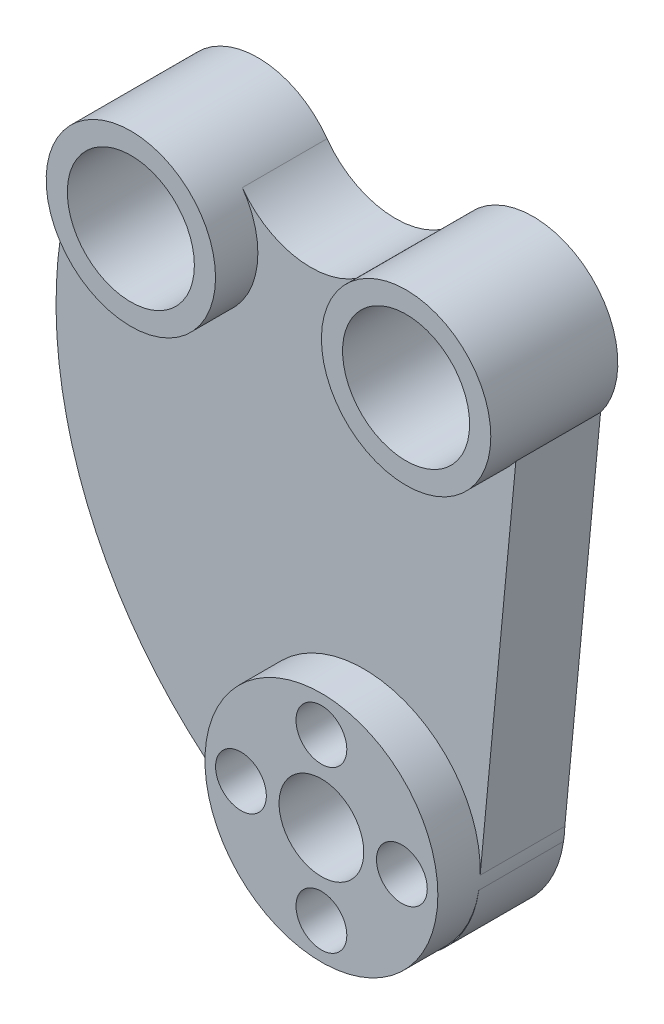
ISO-10303-21;
HEADER;
FILE_DESCRIPTION(('STEP AP214'),'2;1');
FILE_NAME('part.step','',(''),(''),'','','');
FILE_SCHEMA(('AUTOMOTIVE_DESIGN { 1 0 10303 214 1 1 1 1 }'));
ENDSEC;
DATA;
#1=APPLICATION_CONTEXT('core data for automotive mechanical design processes');
#2=APPLICATION_PROTOCOL_DEFINITION('international standard','automotive_design',2000,#1);
#3=PRODUCT_CONTEXT('',#1,'mechanical');
#4=PRODUCT('Part','Part','',(#3));
#5=PRODUCT_RELATED_PRODUCT_CATEGORY('part','',(#4));
#6=PRODUCT_DEFINITION_FORMATION('','',#4);
#7=PRODUCT_DEFINITION_CONTEXT('part definition',#1,'design');
#8=PRODUCT_DEFINITION('design','',#6,#7);
#9=PRODUCT_DEFINITION_SHAPE('','',#8);
#10=(LENGTH_UNIT() NAMED_UNIT(*) SI_UNIT(.MILLI.,.METRE.));
#11=(NAMED_UNIT(*) PLANE_ANGLE_UNIT() SI_UNIT($,.RADIAN.));
#12=(NAMED_UNIT(*) SI_UNIT($,.STERADIAN.) SOLID_ANGLE_UNIT());
#13=UNCERTAINTY_MEASURE_WITH_UNIT(LENGTH_MEASURE(1.E-05),#10,'distance_accuracy_value','');
#14=(GEOMETRIC_REPRESENTATION_CONTEXT(3) GLOBAL_UNCERTAINTY_ASSIGNED_CONTEXT((#13)) GLOBAL_UNIT_ASSIGNED_CONTEXT((#10,
#11,#12)) REPRESENTATION_CONTEXT('',''));
#15=CARTESIAN_POINT('',(0.,0.,0.));
#16=DIRECTION('',(0.,0.,1.));
#17=DIRECTION('',(1.,0.,0.));
#18=AXIS2_PLACEMENT_3D('',#15,#16,#17);
#19=CARTESIAN_POINT('',(25.3358041187193,65.7939812133354,20.));
#20=DIRECTION('',(0.,0.,-1.));
#21=DIRECTION('',(-1.,0.,0.));
#22=AXIS2_PLACEMENT_3D('',#19,#20,#21);
#23=CYLINDRICAL_SURFACE('',#22,98.);
#24=DIRECTION('',(0.,0.,-1.));
#25=VECTOR('',#24,1.);
#26=CARTESIAN_POINT('',(-10.3668097873622,-25.471145534362,15.));
#27=LINE('',#26,#25);
#28=CARTESIAN_POINT('',(-10.3668097873622,-25.471145534362,20.));
#29=VERTEX_POINT('',#28);
#30=CARTESIAN_POINT('',(-10.3668097873635,-25.4711455343615,0.));
#31=VERTEX_POINT('',#30);
#32=EDGE_CURVE('E126',#29,#31,#27,.T.);
#33=ORIENTED_EDGE('',*,*,#32,.F.);
#34=CARTESIAN_POINT('',(25.3358041187193,65.7939812133354,20.));
#35=DIRECTION('',(0.,0.,1.));
#36=DIRECTION('',(-1.,0.,0.));
#37=AXIS2_PLACEMENT_3D('',#34,#35,#36);
#38=CIRCLE('',#37,98.);
#39=CARTESIAN_POINT('',(-64.1691823820229,105.704598741782,20.));
#40=VERTEX_POINT('',#39);
#41=EDGE_CURVE('E113',#40,#29,#38,.T.);
#42=ORIENTED_EDGE('',*,*,#41,.F.);
#43=DIRECTION('',(0.,0.,-1.));
#44=VECTOR('',#43,1.);
#45=CARTESIAN_POINT('',(-64.169182382023,105.704598741782,10.));
#46=LINE('',#45,#44);
#47=CARTESIAN_POINT('',(-64.1691823820229,105.704598741782,0.));
#48=VERTEX_POINT('',#47);
#49=EDGE_CURVE('E137',#40,#48,#46,.T.);
#50=ORIENTED_EDGE('',*,*,#49,.T.);
#51=CARTESIAN_POINT('',(25.3358041187193,65.7939812133354,0.));
#52=DIRECTION('',(0.,0.,1.));
#53=DIRECTION('',(-1.,0.,0.));
#54=AXIS2_PLACEMENT_3D('',#51,#52,#53);
#55=CIRCLE('',#54,98.);
#56=EDGE_CURVE('E127',#48,#31,#55,.T.);
#57=ORIENTED_EDGE('',*,*,#56,.T.);
#58=EDGE_LOOP('',(#33,#42,#50,#57));
#59=FACE_BOUND('',#58,.T.);
#60=ADVANCED_FACE('F41',(#59),#23,.T.);
#61=CARTESIAN_POINT('',(35.9145681731066,87.8869277281302,20.));
#62=DIRECTION('',(-0.995528702857824,0.0944595245923769,0.));
#63=DIRECTION('',(-0.0944595245923769,-0.995528702857824,0.));
#64=AXIS2_PLACEMENT_3D('',#61,#62,#63);
#65=PLANE('',#64);
#66=DIRECTION('',(0.,0.,-1.));
#67=VECTOR('',#66,1.);
#68=CARTESIAN_POINT('',(27.4825292126796,-0.980095951533919,30.));
#69=LINE('',#68,#67);
#70=CARTESIAN_POINT('',(27.4825292126796,-0.980095951533894,0.));
#71=VERTEX_POINT('',#70);
#72=CARTESIAN_POINT('',(27.4825292126796,-0.980095951533919,20.));
#73=VERTEX_POINT('',#72);
#74=EDGE_CURVE('E68',#71,#73,#69,.F.);
#75=ORIENTED_EDGE('',*,*,#74,.F.);
#76=DIRECTION('',(0.0944595245923769,0.995528702857824,0.));
#77=VECTOR('',#76,1.);
#78=CARTESIAN_POINT('',(35.9145681731066,87.8869277281302,0.));
#79=LINE('',#78,#77);
#80=CARTESIAN_POINT('',(35.9145681731068,87.8869277281301,0.));
#81=VERTEX_POINT('',#80);
#82=EDGE_CURVE('E225',#71,#81,#79,.T.);
#83=ORIENTED_EDGE('',*,*,#82,.T.);
#84=DIRECTION('',(0.,0.,-1.));
#85=VECTOR('',#84,1.);
#86=CARTESIAN_POINT('',(35.9145681731068,87.8869277281301,20.));
#87=LINE('',#86,#85);
#88=CARTESIAN_POINT('',(35.9145681731066,87.8869277281302,20.));
#89=VERTEX_POINT('',#88);
#90=EDGE_CURVE('E255',#89,#81,#87,.T.);
#91=ORIENTED_EDGE('',*,*,#90,.F.);
#92=DIRECTION('',(0.0944595245923769,0.995528702857824,0.));
#93=VECTOR('',#92,1.);
#94=CARTESIAN_POINT('',(35.9145681731066,87.8869277281302,20.));
#95=LINE('',#94,#93);
#96=EDGE_CURVE('E241',#73,#89,#95,.T.);
#97=ORIENTED_EDGE('',*,*,#96,.F.);
#98=EDGE_LOOP('',(#75,#83,#91,#97));
#99=FACE_BOUND('',#98,.T.);
#100=ADVANCED_FACE('F184',(#99),#65,.F.);
#101=CARTESIAN_POINT('',(0.244402382688471,-0.413037518556441,20.));
#102=DIRECTION('',(0.,0.,-1.));
#103=DIRECTION('',(-1.,0.,0.));
#104=AXIS2_PLACEMENT_3D('',#101,#102,#103);
#105=PLANE('',#104);
#106=CARTESIAN_POINT('',(0.,0.,20.));
#107=DIRECTION('',(0.,0.,-1.));
#108=DIRECTION('',(-1.,0.,0.));
#109=AXIS2_PLACEMENT_3D('',#106,#107,#108);
#110=CIRCLE('',#109,27.5);
#111=CARTESIAN_POINT('',(-9.39416600842858,-25.8456890990758,20.));
#112=VERTEX_POINT('',#111);
#113=CARTESIAN_POINT('',(27.1764287794754,-4.20615249296824,20.));
#114=VERTEX_POINT('',#113);
#115=EDGE_CURVE('E11',#112,#114,#110,.F.);
#116=ORIENTED_EDGE('',*,*,#115,.F.);
#117=CARTESIAN_POINT('',(0.244402382688471,-0.413037518556441,20.));
#118=DIRECTION('',(0.,0.,1.));
#119=DIRECTION('',(-1.,0.,0.));
#120=AXIS2_PLACEMENT_3D('',#117,#118,#119);
#121=CIRCLE('',#120,27.1978265132774);
#122=EDGE_CURVE('E215',#112,#114,#121,.T.);
#123=ORIENTED_EDGE('',*,*,#122,.T.);
#124=EDGE_LOOP('',(#116,#123));
#125=FACE_BOUND('',#124,.T.);
#126=ADVANCED_FACE('F181',(#125),#105,.F.);
#127=CARTESIAN_POINT('',(-45.,100.,30.));
#128=DIRECTION('',(0.,0.,-1.));
#129=DIRECTION('',(-1.,0.,0.));
#130=AXIS2_PLACEMENT_3D('',#127,#128,#129);
#131=CYLINDRICAL_SURFACE('',#130,20.);
#132=CARTESIAN_POINT('',(-45.,100.,30.));
#133=DIRECTION('',(0.,0.,1.));
#134=DIRECTION('',(1.,0.,0.));
#135=AXIS2_PLACEMENT_3D('',#132,#133,#134);
#136=CIRCLE('',#135,20.);
#137=CARTESIAN_POINT('',(-25.,100.,30.));
#138=VERTEX_POINT('',#137);
#139=EDGE_CURVE('E269',#138,#138,#136,.T.);
#140=ORIENTED_EDGE('',*,*,#139,.F.);
#141=EDGE_LOOP('',(#140));
#142=FACE_BOUND('',#141,.T.);
#143=DIRECTION('',(0.,0.,-1.));
#144=VECTOR('',#143,1.);
#145=CARTESIAN_POINT('',(-28.6766387972563,111.556291751456,20.));
#146=LINE('',#145,#144);
#147=CARTESIAN_POINT('',(-28.6766387972563,111.556291751456,20.));
#148=VERTEX_POINT('',#147);
#149=CARTESIAN_POINT('',(-28.6766387972563,111.556291751456,0.));
#150=VERTEX_POINT('',#149);
#151=EDGE_CURVE('E221',#148,#150,#146,.T.);
#152=ORIENTED_EDGE('',*,*,#151,.T.);
#153=CARTESIAN_POINT('',(-45.,100.,0.));
#154=DIRECTION('',(0.,0.,1.));
#155=DIRECTION('',(1.,0.,0.));
#156=AXIS2_PLACEMENT_3D('',#153,#154,#155);
#157=CIRCLE('',#156,20.);
#158=EDGE_CURVE('E268',#150,#48,#157,.T.);
#159=ORIENTED_EDGE('',*,*,#158,.T.);
#160=ORIENTED_EDGE('',*,*,#49,.F.);
#161=CARTESIAN_POINT('',(-45.,100.,20.));
#162=DIRECTION('',(0.,0.,-1.));
#163=DIRECTION('',(-1.,0.,0.));
#164=AXIS2_PLACEMENT_3D('',#161,#162,#163);
#165=CIRCLE('',#164,20.);
#166=EDGE_CURVE('E118',#148,#40,#165,.T.);
#167=ORIENTED_EDGE('',*,*,#166,.F.);
#168=EDGE_LOOP('',(#152,#159,#160,#167));
#169=FACE_BOUND('',#168,.T.);
#170=ADVANCED_FACE('F43',(#142,#169),#131,.T.);
#171=CARTESIAN_POINT('',(-45.,100.,30.));
#172=DIRECTION('',(0.,0.,-1.));
#173=DIRECTION('',(-1.,0.,0.));
#174=AXIS2_PLACEMENT_3D('',#171,#172,#173);
#175=CYLINDRICAL_SURFACE('',#174,15.);
#176=CARTESIAN_POINT('',(-45.,100.,30.));
#177=DIRECTION('',(0.,0.,1.));
#178=DIRECTION('',(1.,0.,0.));
#179=AXIS2_PLACEMENT_3D('',#176,#177,#178);
#180=CIRCLE('',#179,15.);
#181=CARTESIAN_POINT('',(-30.,100.,30.));
#182=VERTEX_POINT('',#181);
#183=EDGE_CURVE('E264',#182,#182,#180,.T.);
#184=ORIENTED_EDGE('',*,*,#183,.T.);
#185=EDGE_LOOP('',(#184));
#186=FACE_BOUND('',#185,.T.);
#187=CARTESIAN_POINT('',(-45.,100.,0.));
#188=DIRECTION('',(0.,0.,1.));
#189=DIRECTION('',(1.,0.,0.));
#190=AXIS2_PLACEMENT_3D('',#187,#188,#189);
#191=CIRCLE('',#190,15.);
#192=CARTESIAN_POINT('',(-30.,100.,0.));
#193=VERTEX_POINT('',#192);
#194=EDGE_CURVE('E305',#193,#193,#191,.T.);
#195=ORIENTED_EDGE('',*,*,#194,.F.);
#196=EDGE_LOOP('',(#195));
#197=FACE_BOUND('',#196,.T.);
#198=ADVANCED_FACE('F195',(#186,#197),#175,.F.);
#199=CARTESIAN_POINT('',(-45.,100.,30.));
#200=DIRECTION('',(0.,0.,1.));
#201=DIRECTION('',(1.,0.,0.));
#202=AXIS2_PLACEMENT_3D('',#199,#200,#201);
#203=PLANE('',#202);
#204=ORIENTED_EDGE('',*,*,#139,.T.);
#205=EDGE_LOOP('',(#204));
#206=FACE_BOUND('',#205,.T.);
#207=ORIENTED_EDGE('',*,*,#183,.F.);
#208=EDGE_LOOP('',(#207));
#209=FACE_BOUND('',#208,.T.);
#210=ADVANCED_FACE('F198',(#206,#209),#203,.T.);
#211=CARTESIAN_POINT('',(-45.,100.,0.));
#212=DIRECTION('',(0.,0.,1.));
#213=DIRECTION('',(1.,0.,0.));
#214=AXIS2_PLACEMENT_3D('',#211,#212,#213);
#215=PLANE('',#214);
#216=ORIENTED_EDGE('',*,*,#194,.T.);
#217=EDGE_LOOP('',(#216));
#218=FACE_BOUND('',#217,.T.);
#219=CARTESIAN_POINT('',(0.,0.,0.));
#220=DIRECTION('',(0.,0.,1.));
#221=DIRECTION('',(1.,0.,0.));
#222=AXIS2_PLACEMENT_3D('',#219,#220,#221);
#223=CIRCLE('',#222,10.);
#224=CARTESIAN_POINT('',(10.,0.,0.));
#225=VERTEX_POINT('',#224);
#226=EDGE_CURVE('E331',#225,#225,#223,.T.);
#227=ORIENTED_EDGE('',*,*,#226,.T.);
#228=EDGE_LOOP('',(#227));
#229=FACE_BOUND('',#228,.T.);
#230=CARTESIAN_POINT('',(19.,0.,0.));
#231=DIRECTION('',(0.,0.,1.));
#232=DIRECTION('',(1.,0.,0.));
#233=AXIS2_PLACEMENT_3D('',#230,#231,#232);
#234=CIRCLE('',#233,6.);
#235=CARTESIAN_POINT('',(25.,0.,0.));
#236=VERTEX_POINT('',#235);
#237=EDGE_CURVE('E319',#236,#236,#234,.T.);
#238=ORIENTED_EDGE('',*,*,#237,.T.);
#239=EDGE_LOOP('',(#238));
#240=FACE_BOUND('',#239,.T.);
#241=CARTESIAN_POINT('',(0.,-19.,0.));
#242=DIRECTION('',(0.,0.,1.));
#243=DIRECTION('',(1.,0.,0.));
#244=AXIS2_PLACEMENT_3D('',#241,#242,#243);
#245=CIRCLE('',#244,6.);
#246=CARTESIAN_POINT('',(6.,-19.,0.));
#247=VERTEX_POINT('',#246);
#248=EDGE_CURVE('E323',#247,#247,#245,.T.);
#249=ORIENTED_EDGE('',*,*,#248,.T.);
#250=EDGE_LOOP('',(#249));
#251=FACE_BOUND('',#250,.T.);
#252=CARTESIAN_POINT('',(-19.,0.,0.));
#253=DIRECTION('',(0.,0.,1.));
#254=DIRECTION('',(1.,0.,0.));
#255=AXIS2_PLACEMENT_3D('',#252,#253,#254);
#256=CIRCLE('',#255,6.);
#257=CARTESIAN_POINT('',(-13.,0.,0.));
#258=VERTEX_POINT('',#257);
#259=EDGE_CURVE('E327',#258,#258,#256,.T.);
#260=ORIENTED_EDGE('',*,*,#259,.T.);
#261=EDGE_LOOP('',(#260));
#262=FACE_BOUND('',#261,.T.);
#263=CARTESIAN_POINT('',(0.,19.,0.));
#264=DIRECTION('',(0.,0.,1.));
#265=DIRECTION('',(1.,0.,0.));
#266=AXIS2_PLACEMENT_3D('',#263,#264,#265);
#267=CIRCLE('',#266,6.);
#268=CARTESIAN_POINT('',(6.,19.,0.));
#269=VERTEX_POINT('',#268);
#270=EDGE_CURVE('E335',#269,#269,#267,.T.);
#271=ORIENTED_EDGE('',*,*,#270,.T.);
#272=EDGE_LOOP('',(#271));
#273=FACE_BOUND('',#272,.T.);
#274=CARTESIAN_POINT('',(20.,100.,0.));
#275=DIRECTION('',(0.,0.,1.));
#276=DIRECTION('',(1.,0.,0.));
#277=AXIS2_PLACEMENT_3D('',#274,#275,#276);
#278=CIRCLE('',#277,15.);
#279=CARTESIAN_POINT('',(35.,100.,0.));
#280=VERTEX_POINT('',#279);
#281=EDGE_CURVE('E315',#280,#280,#278,.T.);
#282=ORIENTED_EDGE('',*,*,#281,.T.);
#283=EDGE_LOOP('',(#282));
#284=FACE_BOUND('',#283,.T.);
#285=ORIENTED_EDGE('',*,*,#82,.F.);
#286=CARTESIAN_POINT('',(0.,0.,0.));
#287=DIRECTION('',(0.,0.,1.));
#288=DIRECTION('',(1.,0.,0.));
#289=AXIS2_PLACEMENT_3D('',#286,#287,#288);
#290=CIRCLE('',#289,27.5);
#291=CARTESIAN_POINT('',(27.1764287794754,-4.20615249296824,0.));
#292=VERTEX_POINT('',#291);
#293=EDGE_CURVE('E284',#292,#71,#290,.T.);
#294=ORIENTED_EDGE('',*,*,#293,.F.);
#295=CARTESIAN_POINT('',(0.244402382688471,-0.413037518556441,0.));
#296=DIRECTION('',(0.,0.,1.));
#297=DIRECTION('',(-1.,0.,0.));
#298=AXIS2_PLACEMENT_3D('',#295,#296,#297);
#299=CIRCLE('',#298,27.1978265132774);
#300=CARTESIAN_POINT('',(-9.39416600842858,-25.8456890990758,0.));
#301=VERTEX_POINT('',#300);
#302=EDGE_CURVE('E223',#301,#292,#299,.T.);
#303=ORIENTED_EDGE('',*,*,#302,.F.);
#304=CARTESIAN_POINT('',(0.,0.,0.));
#305=DIRECTION('',(0.,0.,1.));
#306=DIRECTION('',(-0.376974901358674,-0.926223473976782,0.));
#307=AXIS2_PLACEMENT_3D('',#304,#305,#306);
#308=CIRCLE('',#307,27.5);
#309=EDGE_CURVE('E59',#31,#301,#308,.T.);
#310=ORIENTED_EDGE('',*,*,#309,.F.);
#311=ORIENTED_EDGE('',*,*,#56,.F.);
#312=ORIENTED_EDGE('',*,*,#158,.F.);
#313=CARTESIAN_POINT('',(-12.5,123.317089225399,0.));
#314=DIRECTION('',(0.,0.,-1.));
#315=DIRECTION('',(1.,0.,0.));
#316=AXIS2_PLACEMENT_3D('',#313,#314,#315);
#317=CIRCLE('',#316,20.);
#318=CARTESIAN_POINT('',(3.67663879725634,111.556291751456,0.));
#319=VERTEX_POINT('',#318);
#320=EDGE_CURVE('E216',#319,#150,#317,.T.);
#321=ORIENTED_EDGE('',*,*,#320,.F.);
#322=CARTESIAN_POINT('',(20.,100.,0.));
#323=DIRECTION('',(0.,0.,1.));
#324=DIRECTION('',(1.,0.,0.));
#325=AXIS2_PLACEMENT_3D('',#322,#323,#324);
#326=CIRCLE('',#325,20.);
#327=EDGE_CURVE('E233',#81,#319,#326,.T.);
#328=ORIENTED_EDGE('',*,*,#327,.F.);
#329=EDGE_LOOP('',(#285,#294,#303,#310,#311,#312,#321,#328));
#330=FACE_BOUND('',#329,.T.);
#331=ADVANCED_FACE('F193',(#218,#229,#240,#251,#262,#273,#284,#330),#215,.F.);
#332=CARTESIAN_POINT('',(0.244402382688471,-0.413037518556441,20.));
#333=DIRECTION('',(0.,0.,-1.));
#334=DIRECTION('',(-1.,0.,0.));
#335=AXIS2_PLACEMENT_3D('',#332,#333,#334);
#336=CYLINDRICAL_SURFACE('',#335,27.1978265132774);
#337=ORIENTED_EDGE('',*,*,#302,.T.);
#338=DIRECTION('',(0.,0.,-1.));
#339=VECTOR('',#338,1.);
#340=CARTESIAN_POINT('',(27.1764287794754,-4.20615249296824,20.));
#341=LINE('',#340,#339);
#342=EDGE_CURVE('E259',#114,#292,#341,.T.);
#343=ORIENTED_EDGE('',*,*,#342,.F.);
#344=ORIENTED_EDGE('',*,*,#122,.F.);
#345=DIRECTION('',(0.,0.,-1.));
#346=VECTOR('',#345,1.);
#347=CARTESIAN_POINT('',(-9.39416600842858,-25.8456890990758,20.));
#348=LINE('',#347,#346);
#349=EDGE_CURVE('E122',#112,#301,#348,.T.);
#350=ORIENTED_EDGE('',*,*,#349,.T.);
#351=EDGE_LOOP('',(#337,#343,#344,#350));
#352=FACE_BOUND('',#351,.T.);
#353=ADVANCED_FACE('F187',(#352),#336,.T.);
#354=CARTESIAN_POINT('',(-12.5,123.317089225399,20.));
#355=DIRECTION('',(0.,0.,-1.));
#356=DIRECTION('',(-1.,0.,0.));
#357=AXIS2_PLACEMENT_3D('',#354,#355,#356);
#358=CYLINDRICAL_SURFACE('',#357,20.);
#359=ORIENTED_EDGE('',*,*,#320,.T.);
#360=ORIENTED_EDGE('',*,*,#151,.F.);
#361=CARTESIAN_POINT('',(-12.5,123.317089225399,20.));
#362=DIRECTION('',(0.,0.,-1.));
#363=DIRECTION('',(1.,0.,0.));
#364=AXIS2_PLACEMENT_3D('',#361,#362,#363);
#365=CIRCLE('',#364,20.);
#366=CARTESIAN_POINT('',(3.67663879725634,111.556291751456,20.));
#367=VERTEX_POINT('',#366);
#368=EDGE_CURVE('E123',#367,#148,#365,.T.);
#369=ORIENTED_EDGE('',*,*,#368,.F.);
#370=DIRECTION('',(0.,0.,-1.));
#371=VECTOR('',#370,1.);
#372=CARTESIAN_POINT('',(3.67663879725634,111.556291751456,20.));
#373=LINE('',#372,#371);
#374=EDGE_CURVE('E252',#367,#319,#373,.T.);
#375=ORIENTED_EDGE('',*,*,#374,.T.);
#376=EDGE_LOOP('',(#359,#360,#369,#375));
#377=FACE_BOUND('',#376,.T.);
#378=ADVANCED_FACE('F180',(#377),#358,.F.);
#379=EDGE_CURVE('E51',#73,#29,#110,.F.);
#380=ORIENTED_EDGE('',*,*,#379,.F.);
#381=ORIENTED_EDGE('',*,*,#96,.T.);
#382=CARTESIAN_POINT('',(20.,100.,20.));
#383=DIRECTION('',(0.,0.,-1.));
#384=DIRECTION('',(-1.,0.,0.));
#385=AXIS2_PLACEMENT_3D('',#382,#383,#384);
#386=CIRCLE('',#385,20.);
#387=EDGE_CURVE('E134',#367,#89,#386,.F.);
#388=ORIENTED_EDGE('',*,*,#387,.F.);
#389=ORIENTED_EDGE('',*,*,#368,.T.);
#390=ORIENTED_EDGE('',*,*,#166,.T.);
#391=ORIENTED_EDGE('',*,*,#41,.T.);
#392=EDGE_LOOP('',(#380,#381,#388,#389,#390,#391));
#393=FACE_BOUND('',#392,.T.);
#394=ADVANCED_FACE('F115',(#393),#105,.F.);
#395=CARTESIAN_POINT('',(20.,100.,30.));
#396=DIRECTION('',(0.,0.,-1.));
#397=DIRECTION('',(-1.,0.,0.));
#398=AXIS2_PLACEMENT_3D('',#395,#396,#397);
#399=CYLINDRICAL_SURFACE('',#398,20.);
#400=CARTESIAN_POINT('',(20.,100.,30.));
#401=DIRECTION('',(0.,0.,1.));
#402=DIRECTION('',(1.,0.,0.));
#403=AXIS2_PLACEMENT_3D('',#400,#401,#402);
#404=CIRCLE('',#403,20.);
#405=CARTESIAN_POINT('',(40.,100.,30.));
#406=VERTEX_POINT('',#405);
#407=EDGE_CURVE('E226',#406,#406,#404,.T.);
#408=ORIENTED_EDGE('',*,*,#407,.F.);
#409=EDGE_LOOP('',(#408));
#410=FACE_BOUND('',#409,.T.);
#411=ORIENTED_EDGE('',*,*,#387,.T.);
#412=ORIENTED_EDGE('',*,*,#90,.T.);
#413=ORIENTED_EDGE('',*,*,#327,.T.);
#414=ORIENTED_EDGE('',*,*,#374,.F.);
#415=EDGE_LOOP('',(#411,#412,#413,#414));
#416=FACE_BOUND('',#415,.T.);
#417=ADVANCED_FACE('F170',(#410,#416),#399,.T.);
#418=CARTESIAN_POINT('',(20.,100.,30.));
#419=DIRECTION('',(0.,0.,-1.));
#420=DIRECTION('',(-1.,0.,0.));
#421=AXIS2_PLACEMENT_3D('',#418,#419,#420);
#422=CYLINDRICAL_SURFACE('',#421,15.);
#423=CARTESIAN_POINT('',(20.,100.,30.));
#424=DIRECTION('',(0.,0.,1.));
#425=DIRECTION('',(1.,0.,0.));
#426=AXIS2_PLACEMENT_3D('',#423,#424,#425);
#427=CIRCLE('',#426,15.);
#428=CARTESIAN_POINT('',(35.,100.,30.));
#429=VERTEX_POINT('',#428);
#430=EDGE_CURVE('E152',#429,#429,#427,.T.);
#431=ORIENTED_EDGE('',*,*,#430,.T.);
#432=EDGE_LOOP('',(#431));
#433=FACE_BOUND('',#432,.T.);
#434=ORIENTED_EDGE('',*,*,#281,.F.);
#435=EDGE_LOOP('',(#434));
#436=FACE_BOUND('',#435,.T.);
#437=ADVANCED_FACE('F167',(#433,#436),#422,.F.);
#438=CARTESIAN_POINT('',(20.,100.,30.));
#439=DIRECTION('',(0.,0.,1.));
#440=DIRECTION('',(1.,0.,0.));
#441=AXIS2_PLACEMENT_3D('',#438,#439,#440);
#442=PLANE('',#441);
#443=ORIENTED_EDGE('',*,*,#407,.T.);
#444=EDGE_LOOP('',(#443));
#445=FACE_BOUND('',#444,.T.);
#446=ORIENTED_EDGE('',*,*,#430,.F.);
#447=EDGE_LOOP('',(#446));
#448=FACE_BOUND('',#447,.T.);
#449=ADVANCED_FACE('F164',(#445,#448),#442,.T.);
#450=CARTESIAN_POINT('',(0.,0.,30.));
#451=DIRECTION('',(0.,0.,-1.));
#452=DIRECTION('',(-1.,0.,0.));
#453=AXIS2_PLACEMENT_3D('',#450,#451,#452);
#454=CYLINDRICAL_SURFACE('',#453,27.5);
#455=CARTESIAN_POINT('',(0.,0.,30.));
#456=DIRECTION('',(0.,0.,1.));
#457=DIRECTION('',(1.,0.,0.));
#458=AXIS2_PLACEMENT_3D('',#455,#456,#457);
#459=CIRCLE('',#458,27.5);
#460=CARTESIAN_POINT('',(27.5,0.,30.));
#461=VERTEX_POINT('',#460);
#462=EDGE_CURVE('E286',#461,#461,#459,.T.);
#463=ORIENTED_EDGE('',*,*,#462,.F.);
#464=EDGE_LOOP('',(#463));
#465=FACE_BOUND('',#464,.T.);
#466=ORIENTED_EDGE('',*,*,#309,.T.);
#467=ORIENTED_EDGE('',*,*,#349,.F.);
#468=ORIENTED_EDGE('',*,*,#115,.T.);
#469=ORIENTED_EDGE('',*,*,#342,.T.);
#470=ORIENTED_EDGE('',*,*,#293,.T.);
#471=ORIENTED_EDGE('',*,*,#74,.T.);
#472=ORIENTED_EDGE('',*,*,#379,.T.);
#473=ORIENTED_EDGE('',*,*,#32,.T.);
#474=EDGE_LOOP('',(#466,#467,#468,#469,#470,#471,#472,#473));
#475=FACE_BOUND('',#474,.T.);
#476=ADVANCED_FACE('F131',(#465,#475),#454,.T.);
#477=CARTESIAN_POINT('',(0.,0.,30.));
#478=DIRECTION('',(0.,0.,-1.));
#479=DIRECTION('',(-1.,0.,0.));
#480=AXIS2_PLACEMENT_3D('',#477,#478,#479);
#481=CYLINDRICAL_SURFACE('',#480,10.);
#482=CARTESIAN_POINT('',(0.,0.,30.));
#483=DIRECTION('',(0.,0.,1.));
#484=DIRECTION('',(1.,0.,0.));
#485=AXIS2_PLACEMENT_3D('',#482,#483,#484);
#486=CIRCLE('',#485,10.);
#487=CARTESIAN_POINT('',(10.,0.,30.));
#488=VERTEX_POINT('',#487);
#489=EDGE_CURVE('E291',#488,#488,#486,.T.);
#490=ORIENTED_EDGE('',*,*,#489,.T.);
#491=EDGE_LOOP('',(#490));
#492=FACE_BOUND('',#491,.T.);
#493=ORIENTED_EDGE('',*,*,#226,.F.);
#494=EDGE_LOOP('',(#493));
#495=FACE_BOUND('',#494,.T.);
#496=ADVANCED_FACE('F163',(#492,#495),#481,.F.);
#497=CARTESIAN_POINT('',(-19.,0.,30.));
#498=DIRECTION('',(0.,0.,-1.));
#499=DIRECTION('',(-1.,0.,0.));
#500=AXIS2_PLACEMENT_3D('',#497,#498,#499);
#501=CYLINDRICAL_SURFACE('',#500,6.);
#502=CARTESIAN_POINT('',(-19.,0.,30.));
#503=DIRECTION('',(0.,0.,1.));
#504=DIRECTION('',(1.,0.,0.));
#505=AXIS2_PLACEMENT_3D('',#502,#503,#504);
#506=CIRCLE('',#505,6.);
#507=CARTESIAN_POINT('',(-13.,0.,30.));
#508=VERTEX_POINT('',#507);
#509=EDGE_CURVE('E300',#508,#508,#506,.T.);
#510=ORIENTED_EDGE('',*,*,#509,.T.);
#511=EDGE_LOOP('',(#510));
#512=FACE_BOUND('',#511,.T.);
#513=ORIENTED_EDGE('',*,*,#259,.F.);
#514=EDGE_LOOP('',(#513));
#515=FACE_BOUND('',#514,.T.);
#516=ADVANCED_FACE('F359',(#512,#515),#501,.F.);
#517=CARTESIAN_POINT('',(0.,-19.,30.));
#518=DIRECTION('',(0.,0.,-1.));
#519=DIRECTION('',(-1.,0.,0.));
#520=AXIS2_PLACEMENT_3D('',#517,#518,#519);
#521=CYLINDRICAL_SURFACE('',#520,6.);
#522=CARTESIAN_POINT('',(0.,-19.,30.));
#523=DIRECTION('',(0.,0.,1.));
#524=DIRECTION('',(1.,0.,0.));
#525=AXIS2_PLACEMENT_3D('',#522,#523,#524);
#526=CIRCLE('',#525,6.);
#527=CARTESIAN_POINT('',(6.,-19.,30.));
#528=VERTEX_POINT('',#527);
#529=EDGE_CURVE('E304',#528,#528,#526,.T.);
#530=ORIENTED_EDGE('',*,*,#529,.T.);
#531=EDGE_LOOP('',(#530));
#532=FACE_BOUND('',#531,.T.);
#533=ORIENTED_EDGE('',*,*,#248,.F.);
#534=EDGE_LOOP('',(#533));
#535=FACE_BOUND('',#534,.T.);
#536=ADVANCED_FACE('F353',(#532,#535),#521,.F.);
#537=CARTESIAN_POINT('',(19.,0.,30.));
#538=DIRECTION('',(0.,0.,-1.));
#539=DIRECTION('',(-1.,0.,0.));
#540=AXIS2_PLACEMENT_3D('',#537,#538,#539);
#541=CYLINDRICAL_SURFACE('',#540,6.);
#542=CARTESIAN_POINT('',(19.,0.,30.));
#543=DIRECTION('',(0.,0.,1.));
#544=DIRECTION('',(1.,0.,0.));
#545=AXIS2_PLACEMENT_3D('',#542,#543,#544);
#546=CIRCLE('',#545,6.);
#547=CARTESIAN_POINT('',(25.,0.,30.));
#548=VERTEX_POINT('',#547);
#549=EDGE_CURVE('E294',#548,#548,#546,.T.);
#550=ORIENTED_EDGE('',*,*,#549,.T.);
#551=EDGE_LOOP('',(#550));
#552=FACE_BOUND('',#551,.T.);
#553=ORIENTED_EDGE('',*,*,#237,.F.);
#554=EDGE_LOOP('',(#553));
#555=FACE_BOUND('',#554,.T.);
#556=ADVANCED_FACE('F345',(#552,#555),#541,.F.);
#557=CARTESIAN_POINT('',(0.,19.,30.));
#558=DIRECTION('',(0.,0.,-1.));
#559=DIRECTION('',(-1.,0.,0.));
#560=AXIS2_PLACEMENT_3D('',#557,#558,#559);
#561=CYLINDRICAL_SURFACE('',#560,6.);
#562=CARTESIAN_POINT('',(0.,19.,30.));
#563=DIRECTION('',(0.,0.,1.));
#564=DIRECTION('',(1.,0.,0.));
#565=AXIS2_PLACEMENT_3D('',#562,#563,#564);
#566=CIRCLE('',#565,6.);
#567=CARTESIAN_POINT('',(6.,19.,30.));
#568=VERTEX_POINT('',#567);
#569=EDGE_CURVE('E287',#568,#568,#566,.T.);
#570=ORIENTED_EDGE('',*,*,#569,.T.);
#571=EDGE_LOOP('',(#570));
#572=FACE_BOUND('',#571,.T.);
#573=ORIENTED_EDGE('',*,*,#270,.F.);
#574=EDGE_LOOP('',(#573));
#575=FACE_BOUND('',#574,.T.);
#576=ADVANCED_FACE('F342',(#572,#575),#561,.F.);
#577=CARTESIAN_POINT('',(0.,0.,30.));
#578=DIRECTION('',(0.,0.,1.));
#579=DIRECTION('',(1.,0.,0.));
#580=AXIS2_PLACEMENT_3D('',#577,#578,#579);
#581=PLANE('',#580);
#582=ORIENTED_EDGE('',*,*,#569,.F.);
#583=EDGE_LOOP('',(#582));
#584=FACE_BOUND('',#583,.T.);
#585=ORIENTED_EDGE('',*,*,#549,.F.);
#586=EDGE_LOOP('',(#585));
#587=FACE_BOUND('',#586,.T.);
#588=ORIENTED_EDGE('',*,*,#529,.F.);
#589=EDGE_LOOP('',(#588));
#590=FACE_BOUND('',#589,.T.);
#591=ORIENTED_EDGE('',*,*,#509,.F.);
#592=EDGE_LOOP('',(#591));
#593=FACE_BOUND('',#592,.T.);
#594=ORIENTED_EDGE('',*,*,#462,.T.);
#595=EDGE_LOOP('',(#594));
#596=FACE_BOUND('',#595,.T.);
#597=ORIENTED_EDGE('',*,*,#489,.F.);
#598=EDGE_LOOP('',(#597));
#599=FACE_BOUND('',#598,.T.);
#600=ADVANCED_FACE('F344',(#584,#587,#590,#593,#596,#599),#581,.T.);
#601=CLOSED_SHELL('',(#60,#100,#126,#170,#198,#210,#331,#353,#378,#394,#417,#437,#449,#476,#496,
#516,#536,#556,#576,#600));
#602=MANIFOLD_SOLID_BREP('B2',#601);
#603=ADVANCED_BREP_SHAPE_REPRESENTATION('',(#18,#602),#14);
#604=SHAPE_DEFINITION_REPRESENTATION(#9,#603);
ENDSEC;
END-ISO-10303-21;
